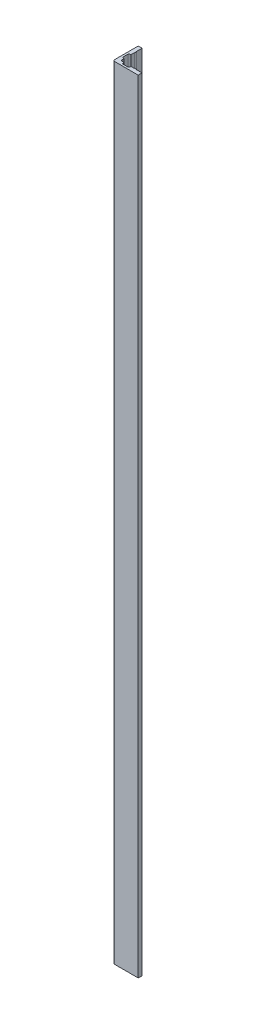
ISO-10303-21;
HEADER;
FILE_DESCRIPTION(('STEP AP214'),'2;1');
FILE_NAME('part.step','',(''),(''),'','','');
FILE_SCHEMA(('AUTOMOTIVE_DESIGN { 1 0 10303 214 1 1 1 1 }'));
ENDSEC;
DATA;
#1=APPLICATION_CONTEXT('core data for automotive mechanical design processes');
#2=APPLICATION_PROTOCOL_DEFINITION('international standard','automotive_design',2000,#1);
#3=PRODUCT_CONTEXT('',#1,'mechanical');
#4=PRODUCT('Part','Part','',(#3));
#5=PRODUCT_RELATED_PRODUCT_CATEGORY('part','',(#4));
#6=PRODUCT_DEFINITION_FORMATION('','',#4);
#7=PRODUCT_DEFINITION_CONTEXT('part definition',#1,'design');
#8=PRODUCT_DEFINITION('design','',#6,#7);
#9=PRODUCT_DEFINITION_SHAPE('','',#8);
#10=(LENGTH_UNIT() NAMED_UNIT(*) SI_UNIT(.MILLI.,.METRE.));
#11=(NAMED_UNIT(*) PLANE_ANGLE_UNIT() SI_UNIT($,.RADIAN.));
#12=(NAMED_UNIT(*) SI_UNIT($,.STERADIAN.) SOLID_ANGLE_UNIT());
#13=UNCERTAINTY_MEASURE_WITH_UNIT(LENGTH_MEASURE(1.E-05),#10,'distance_accuracy_value','');
#14=(GEOMETRIC_REPRESENTATION_CONTEXT(3) GLOBAL_UNCERTAINTY_ASSIGNED_CONTEXT((#13)) GLOBAL_UNIT_ASSIGNED_CONTEXT((#10,
#11,#12)) REPRESENTATION_CONTEXT('',''));
#15=CARTESIAN_POINT('',(0.,0.,0.));
#16=DIRECTION('',(0.,0.,1.));
#17=DIRECTION('',(1.,0.,0.));
#18=AXIS2_PLACEMENT_3D('',#15,#16,#17);
#19=CARTESIAN_POINT('',(0.,1828.8,-50.));
#20=DIRECTION('',(-1.,0.,0.));
#21=DIRECTION('',(0.,0.,1.));
#22=AXIS2_PLACEMENT_3D('',#19,#20,#21);
#23=PLANE('',#22);
#24=DIRECTION('',(0.,0.,-1.));
#25=VECTOR('',#24,1.);
#26=CARTESIAN_POINT('',(0.,1828.8,-50.));
#27=LINE('',#26,#25);
#28=CARTESIAN_POINT('',(0.,1828.8,-3.66));
#29=VERTEX_POINT('',#28);
#30=CARTESIAN_POINT('',(0.,1828.8,-8.));
#31=VERTEX_POINT('',#30);
#32=EDGE_CURVE('E388',#29,#31,#27,.T.);
#33=ORIENTED_EDGE('',*,*,#32,.F.);
#34=DIRECTION('',(0.,-1.,0.));
#35=VECTOR('',#34,1.);
#36=CARTESIAN_POINT('',(0.,0.,-3.66));
#37=LINE('',#36,#35);
#38=CARTESIAN_POINT('',(0.,0.,-3.66));
#39=VERTEX_POINT('',#38);
#40=EDGE_CURVE('E350',#29,#39,#37,.T.);
#41=ORIENTED_EDGE('',*,*,#40,.T.);
#42=DIRECTION('',(0.,0.,-1.));
#43=VECTOR('',#42,1.);
#44=CARTESIAN_POINT('',(0.,0.,-50.));
#45=LINE('',#44,#43);
#46=CARTESIAN_POINT('',(0.,0.,-8.));
#47=VERTEX_POINT('',#46);
#48=EDGE_CURVE('E255',#39,#47,#45,.T.);
#49=ORIENTED_EDGE('',*,*,#48,.T.);
#50=DIRECTION('',(0.,1.,0.));
#51=VECTOR('',#50,1.);
#52=CARTESIAN_POINT('',(0.,0.,-8.));
#53=LINE('',#52,#51);
#54=EDGE_CURVE('E246',#47,#31,#53,.T.);
#55=ORIENTED_EDGE('',*,*,#54,.T.);
#56=EDGE_LOOP('',(#33,#41,#49,#55));
#57=FACE_BOUND('',#56,.T.);
#58=ADVANCED_FACE('F39',(#57),#23,.F.);
#59=CARTESIAN_POINT('',(0.,1828.8,0.));
#60=DIRECTION('',(0.,0.,1.));
#61=DIRECTION('',(1.,0.,0.));
#62=AXIS2_PLACEMENT_3D('',#59,#60,#61);
#63=PLANE('',#62);
#64=DIRECTION('',(-1.,0.,0.));
#65=VECTOR('',#64,1.);
#66=CARTESIAN_POINT('',(0.,0.,0.));
#67=LINE('',#66,#65);
#68=CARTESIAN_POINT('',(8.,0.,0.));
#69=VERTEX_POINT('',#68);
#70=CARTESIAN_POINT('',(3.66,0.,0.));
#71=VERTEX_POINT('',#70);
#72=EDGE_CURVE('E277',#69,#71,#67,.T.);
#73=ORIENTED_EDGE('',*,*,#72,.T.);
#74=DIRECTION('',(0.,-1.,0.));
#75=VECTOR('',#74,1.);
#76=CARTESIAN_POINT('',(3.66,1828.8,0.));
#77=LINE('',#76,#75);
#78=CARTESIAN_POINT('',(3.66,1828.8,0.));
#79=VERTEX_POINT('',#78);
#80=EDGE_CURVE('E354',#71,#79,#77,.F.);
#81=ORIENTED_EDGE('',*,*,#80,.T.);
#82=DIRECTION('',(-1.,0.,0.));
#83=VECTOR('',#82,1.);
#84=CARTESIAN_POINT('',(0.,1828.8,0.));
#85=LINE('',#84,#83);
#86=CARTESIAN_POINT('',(8.,1828.8,0.));
#87=VERTEX_POINT('',#86);
#88=EDGE_CURVE('E373',#87,#79,#85,.T.);
#89=ORIENTED_EDGE('',*,*,#88,.F.);
#90=DIRECTION('',(0.,1.,0.));
#91=VECTOR('',#90,1.);
#92=CARTESIAN_POINT('',(8.,0.,0.));
#93=LINE('',#92,#91);
#94=EDGE_CURVE('E403',#69,#87,#93,.T.);
#95=ORIENTED_EDGE('',*,*,#94,.F.);
#96=EDGE_LOOP('',(#73,#81,#89,#95));
#97=FACE_BOUND('',#96,.T.);
#98=ADVANCED_FACE('F401',(#97),#63,.F.);
#99=CARTESIAN_POINT('',(31.75,0.,0.));
#100=VERTEX_POINT('',#99);
#101=CARTESIAN_POINT('',(23.75,0.,0.));
#102=VERTEX_POINT('',#101);
#103=EDGE_CURVE('E282',#100,#102,#67,.T.);
#104=ORIENTED_EDGE('',*,*,#103,.T.);
#105=DIRECTION('',(0.,1.,0.));
#106=VECTOR('',#105,1.);
#107=CARTESIAN_POINT('',(23.75,0.,0.));
#108=LINE('',#107,#106);
#109=CARTESIAN_POINT('',(23.75,1828.8,0.));
#110=VERTEX_POINT('',#109);
#111=EDGE_CURVE('E442',#102,#110,#108,.T.);
#112=ORIENTED_EDGE('',*,*,#111,.T.);
#113=CARTESIAN_POINT('',(31.75,1828.8,0.));
#114=VERTEX_POINT('',#113);
#115=EDGE_CURVE('E372',#114,#110,#85,.T.);
#116=ORIENTED_EDGE('',*,*,#115,.F.);
#117=DIRECTION('',(0.,1.,0.));
#118=VECTOR('',#117,1.);
#119=CARTESIAN_POINT('',(31.75,0.,0.));
#120=LINE('',#119,#118);
#121=EDGE_CURVE('E468',#100,#114,#120,.T.);
#122=ORIENTED_EDGE('',*,*,#121,.F.);
#123=EDGE_LOOP('',(#104,#112,#116,#122));
#124=FACE_BOUND('',#123,.T.);
#125=ADVANCED_FACE('F568',(#124),#63,.F.);
#126=CARTESIAN_POINT('',(0.,1828.8,-35.75));
#127=VERTEX_POINT('',#126);
#128=CARTESIAN_POINT('',(0.,1828.8,-50.));
#129=VERTEX_POINT('',#128);
#130=EDGE_CURVE('E281',#127,#129,#27,.T.);
#131=ORIENTED_EDGE('',*,*,#130,.F.);
#132=DIRECTION('',(0.,1.,0.));
#133=VECTOR('',#132,1.);
#134=CARTESIAN_POINT('',(0.,0.,-35.75));
#135=LINE('',#134,#133);
#136=CARTESIAN_POINT('',(0.,0.,-35.75));
#137=VERTEX_POINT('',#136);
#138=EDGE_CURVE('E261',#137,#127,#135,.T.);
#139=ORIENTED_EDGE('',*,*,#138,.F.);
#140=CARTESIAN_POINT('',(0.,0.,-50.));
#141=VERTEX_POINT('',#140);
#142=EDGE_CURVE('E256',#137,#141,#45,.T.);
#143=ORIENTED_EDGE('',*,*,#142,.T.);
#144=DIRECTION('',(0.,-1.,0.));
#145=VECTOR('',#144,1.);
#146=CARTESIAN_POINT('',(0.,1828.8,-50.));
#147=LINE('',#146,#145);
#148=EDGE_CURVE('E295',#129,#141,#147,.T.);
#149=ORIENTED_EDGE('',*,*,#148,.F.);
#150=EDGE_LOOP('',(#131,#139,#143,#149));
#151=FACE_BOUND('',#150,.T.);
#152=ADVANCED_FACE('F564',(#151),#23,.F.);
#153=CARTESIAN_POINT('',(0.,1828.8,-23.75));
#154=VERTEX_POINT('',#153);
#155=CARTESIAN_POINT('',(0.,1828.8,-31.75));
#156=VERTEX_POINT('',#155);
#157=EDGE_CURVE('E244',#154,#156,#27,.T.);
#158=ORIENTED_EDGE('',*,*,#157,.F.);
#159=DIRECTION('',(0.,1.,0.));
#160=VECTOR('',#159,1.);
#161=CARTESIAN_POINT('',(0.,0.,-23.75));
#162=LINE('',#161,#160);
#163=CARTESIAN_POINT('',(0.,0.,-23.75));
#164=VERTEX_POINT('',#163);
#165=EDGE_CURVE('E228',#164,#154,#162,.T.);
#166=ORIENTED_EDGE('',*,*,#165,.F.);
#167=CARTESIAN_POINT('',(0.,0.,-31.75));
#168=VERTEX_POINT('',#167);
#169=EDGE_CURVE('E242',#164,#168,#45,.T.);
#170=ORIENTED_EDGE('',*,*,#169,.T.);
#171=DIRECTION('',(0.,1.,0.));
#172=VECTOR('',#171,1.);
#173=CARTESIAN_POINT('',(0.,0.,-31.75));
#174=LINE('',#173,#172);
#175=EDGE_CURVE('E503',#168,#156,#174,.T.);
#176=ORIENTED_EDGE('',*,*,#175,.T.);
#177=EDGE_LOOP('',(#158,#166,#170,#176));
#178=FACE_BOUND('',#177,.T.);
#179=ADVANCED_FACE('F240',(#178),#23,.F.);
#180=CARTESIAN_POINT('',(-9.,1828.8,-50.));
#181=DIRECTION('',(0.,0.,1.));
#182=DIRECTION('',(1.,0.,0.));
#183=AXIS2_PLACEMENT_3D('',#180,#181,#182);
#184=PLANE('',#183);
#185=DIRECTION('',(-1.,0.,0.));
#186=VECTOR('',#185,1.);
#187=CARTESIAN_POINT('',(-9.,0.,-50.));
#188=LINE('',#187,#186);
#189=CARTESIAN_POINT('',(-9.,0.,-50.));
#190=VERTEX_POINT('',#189);
#191=EDGE_CURVE('E260',#141,#190,#188,.T.);
#192=ORIENTED_EDGE('',*,*,#191,.T.);
#193=DIRECTION('',(0.,-1.,0.));
#194=VECTOR('',#193,1.);
#195=CARTESIAN_POINT('',(-9.,1828.8,-50.));
#196=LINE('',#195,#194);
#197=CARTESIAN_POINT('',(-9.,1828.8,-50.));
#198=VERTEX_POINT('',#197);
#199=EDGE_CURVE('E291',#198,#190,#196,.T.);
#200=ORIENTED_EDGE('',*,*,#199,.F.);
#201=DIRECTION('',(-1.,0.,0.));
#202=VECTOR('',#201,1.);
#203=CARTESIAN_POINT('',(-9.,1828.8,-50.));
#204=LINE('',#203,#202);
#205=EDGE_CURVE('E385',#129,#198,#204,.T.);
#206=ORIENTED_EDGE('',*,*,#205,.F.);
#207=ORIENTED_EDGE('',*,*,#148,.T.);
#208=EDGE_LOOP('',(#192,#200,#206,#207));
#209=FACE_BOUND('',#208,.T.);
#210=ADVANCED_FACE('F576',(#209),#184,.F.);
#211=CARTESIAN_POINT('',(-9.,1828.8,9.00000000000001));
#212=DIRECTION('',(1.,0.,0.));
#213=DIRECTION('',(0.,0.,-1.));
#214=AXIS2_PLACEMENT_3D('',#211,#212,#213);
#215=PLANE('',#214);
#216=DIRECTION('',(0.,0.,1.));
#217=VECTOR('',#216,1.);
#218=CARTESIAN_POINT('',(-9.,0.,9.00000000000001));
#219=LINE('',#218,#217);
#220=CARTESIAN_POINT('',(-9.,0.,5.34000000000001));
#221=VERTEX_POINT('',#220);
#222=EDGE_CURVE('E268',#190,#221,#219,.T.);
#223=ORIENTED_EDGE('',*,*,#222,.T.);
#224=DIRECTION('',(0.,-1.,0.));
#225=VECTOR('',#224,1.);
#226=CARTESIAN_POINT('',(-9.,1828.8,5.34000000000001));
#227=LINE('',#226,#225);
#228=CARTESIAN_POINT('',(-9.,1828.8,5.34000000000001));
#229=VERTEX_POINT('',#228);
#230=EDGE_CURVE('E48',#221,#229,#227,.F.);
#231=ORIENTED_EDGE('',*,*,#230,.T.);
#232=DIRECTION('',(0.,0.,1.));
#233=VECTOR('',#232,1.);
#234=CARTESIAN_POINT('',(-9.,1828.8,9.00000000000001));
#235=LINE('',#234,#233);
#236=EDGE_CURVE('E382',#198,#229,#235,.T.);
#237=ORIENTED_EDGE('',*,*,#236,.F.);
#238=ORIENTED_EDGE('',*,*,#199,.T.);
#239=EDGE_LOOP('',(#223,#231,#237,#238));
#240=FACE_BOUND('',#239,.T.);
#241=ADVANCED_FACE('F580',(#240),#215,.F.);
#242=CARTESIAN_POINT('',(50.,1828.8,9.));
#243=DIRECTION('',(0.,0.,-1.));
#244=DIRECTION('',(-1.,0.,0.));
#245=AXIS2_PLACEMENT_3D('',#242,#243,#244);
#246=PLANE('',#245);
#247=DIRECTION('',(1.,0.,0.));
#248=VECTOR('',#247,1.);
#249=CARTESIAN_POINT('',(50.,1828.8,9.));
#250=LINE('',#249,#248);
#251=CARTESIAN_POINT('',(-5.33999999999998,1828.8,9.00000000000001));
#252=VERTEX_POINT('',#251);
#253=CARTESIAN_POINT('',(50.,1828.8,9.));
#254=VERTEX_POINT('',#253);
#255=EDGE_CURVE('E380',#252,#254,#250,.T.);
#256=ORIENTED_EDGE('',*,*,#255,.F.);
#257=DIRECTION('',(0.,-1.,0.));
#258=VECTOR('',#257,1.);
#259=CARTESIAN_POINT('',(-5.34,1828.8,9.00000000000001));
#260=LINE('',#259,#258);
#261=CARTESIAN_POINT('',(-5.33999999999998,0.,9.00000000000001));
#262=VERTEX_POINT('',#261);
#263=EDGE_CURVE('E363',#252,#262,#260,.T.);
#264=ORIENTED_EDGE('',*,*,#263,.T.);
#265=DIRECTION('',(1.,0.,0.));
#266=VECTOR('',#265,1.);
#267=CARTESIAN_POINT('',(50.,0.,9.));
#268=LINE('',#267,#266);
#269=CARTESIAN_POINT('',(50.,0.,9.));
#270=VERTEX_POINT('',#269);
#271=EDGE_CURVE('E271',#262,#270,#268,.T.);
#272=ORIENTED_EDGE('',*,*,#271,.T.);
#273=DIRECTION('',(0.,-1.,0.));
#274=VECTOR('',#273,1.);
#275=CARTESIAN_POINT('',(50.,1828.8,9.));
#276=LINE('',#275,#274);
#277=EDGE_CURVE('E287',#254,#270,#276,.T.);
#278=ORIENTED_EDGE('',*,*,#277,.F.);
#279=EDGE_LOOP('',(#256,#264,#272,#278));
#280=FACE_BOUND('',#279,.T.);
#281=ADVANCED_FACE('F585',(#280),#246,.F.);
#282=CARTESIAN_POINT('',(50.,1828.8,0.));
#283=DIRECTION('',(-1.,0.,0.));
#284=DIRECTION('',(0.,0.,1.));
#285=AXIS2_PLACEMENT_3D('',#282,#283,#284);
#286=PLANE('',#285);
#287=DIRECTION('',(0.,0.,-1.));
#288=VECTOR('',#287,1.);
#289=CARTESIAN_POINT('',(50.,0.,0.));
#290=LINE('',#289,#288);
#291=CARTESIAN_POINT('',(50.,0.,0.));
#292=VERTEX_POINT('',#291);
#293=EDGE_CURVE('E274',#270,#292,#290,.T.);
#294=ORIENTED_EDGE('',*,*,#293,.T.);
#295=DIRECTION('',(0.,-1.,0.));
#296=VECTOR('',#295,1.);
#297=CARTESIAN_POINT('',(50.,1828.8,0.));
#298=LINE('',#297,#296);
#299=CARTESIAN_POINT('',(50.,1828.8,0.));
#300=VERTEX_POINT('',#299);
#301=EDGE_CURVE('E283',#300,#292,#298,.T.);
#302=ORIENTED_EDGE('',*,*,#301,.F.);
#303=DIRECTION('',(0.,0.,-1.));
#304=VECTOR('',#303,1.);
#305=CARTESIAN_POINT('',(50.,1828.8,0.));
#306=LINE('',#305,#304);
#307=EDGE_CURVE('E378',#254,#300,#306,.T.);
#308=ORIENTED_EDGE('',*,*,#307,.F.);
#309=ORIENTED_EDGE('',*,*,#277,.T.);
#310=EDGE_LOOP('',(#294,#302,#308,#309));
#311=FACE_BOUND('',#310,.T.);
#312=ADVANCED_FACE('F590',(#311),#286,.F.);
#313=CARTESIAN_POINT('',(35.75,0.,0.));
#314=VERTEX_POINT('',#313);
#315=EDGE_CURVE('E278',#292,#314,#67,.T.);
#316=ORIENTED_EDGE('',*,*,#315,.T.);
#317=DIRECTION('',(0.,1.,0.));
#318=VECTOR('',#317,1.);
#319=CARTESIAN_POINT('',(35.75,0.,0.));
#320=LINE('',#319,#318);
#321=CARTESIAN_POINT('',(35.75,1828.8,0.));
#322=VERTEX_POINT('',#321);
#323=EDGE_CURVE('E486',#314,#322,#320,.T.);
#324=ORIENTED_EDGE('',*,*,#323,.T.);
#325=EDGE_CURVE('E264',#300,#322,#85,.T.);
#326=ORIENTED_EDGE('',*,*,#325,.F.);
#327=ORIENTED_EDGE('',*,*,#301,.T.);
#328=EDGE_LOOP('',(#316,#324,#326,#327));
#329=FACE_BOUND('',#328,.T.);
#330=ADVANCED_FACE('F570',(#329),#63,.F.);
#331=CARTESIAN_POINT('',(0.,1828.8,0.));
#332=DIRECTION('',(0.,1.,0.));
#333=DIRECTION('',(0.,0.,1.));
#334=AXIS2_PLACEMENT_3D('',#331,#332,#333);
#335=PLANE('',#334);
#336=ORIENTED_EDGE('',*,*,#236,.T.);
#337=CARTESIAN_POINT('',(-5.34,1828.8,5.34000000000001));
#338=DIRECTION('',(0.,1.,0.));
#339=DIRECTION('',(0.,0.,1.));
#340=AXIS2_PLACEMENT_3D('',#337,#338,#339);
#341=CIRCLE('',#340,3.66);
#342=EDGE_CURVE('E11',#229,#252,#341,.T.);
#343=ORIENTED_EDGE('',*,*,#342,.T.);
#344=ORIENTED_EDGE('',*,*,#255,.T.);
#345=ORIENTED_EDGE('',*,*,#307,.T.);
#346=ORIENTED_EDGE('',*,*,#325,.T.);
#347=DIRECTION('',(0.,0.,-1.));
#348=VECTOR('',#347,1.);
#349=CARTESIAN_POINT('',(35.75,1828.8,0.));
#350=LINE('',#349,#348);
#351=CARTESIAN_POINT('',(35.75,1828.8,-1.));
#352=VERTEX_POINT('',#351);
#353=EDGE_CURVE('E472',#322,#352,#350,.T.);
#354=ORIENTED_EDGE('',*,*,#353,.T.);
#355=DIRECTION('',(-1.,0.,0.));
#356=VECTOR('',#355,1.);
#357=CARTESIAN_POINT('',(31.75,1828.8,-1.));
#358=LINE('',#357,#356);
#359=CARTESIAN_POINT('',(31.75,1828.8,-1.));
#360=VERTEX_POINT('',#359);
#361=EDGE_CURVE('E460',#352,#360,#358,.T.);
#362=ORIENTED_EDGE('',*,*,#361,.T.);
#363=DIRECTION('',(0.,0.,1.));
#364=VECTOR('',#363,1.);
#365=CARTESIAN_POINT('',(31.75,1828.8,0.));
#366=LINE('',#365,#364);
#367=EDGE_CURVE('E451',#360,#114,#366,.T.);
#368=ORIENTED_EDGE('',*,*,#367,.T.);
#369=ORIENTED_EDGE('',*,*,#115,.T.);
#370=DIRECTION('',(0.,0.,-1.));
#371=VECTOR('',#370,1.);
#372=CARTESIAN_POINT('',(23.75,1828.8,0.));
#373=LINE('',#372,#371);
#374=CARTESIAN_POINT('',(23.75,1828.8,2.5));
#375=VERTEX_POINT('',#374);
#376=EDGE_CURVE('E436',#375,#110,#373,.T.);
#377=ORIENTED_EDGE('',*,*,#376,.F.);
#378=CARTESIAN_POINT('',(21.75,1828.8,2.5));
#379=DIRECTION('',(0.,1.,0.));
#380=DIRECTION('',(0.,0.,1.));
#381=AXIS2_PLACEMENT_3D('',#378,#379,#380);
#382=CIRCLE('',#381,2.);
#383=CARTESIAN_POINT('',(21.75,1828.8,4.5));
#384=VERTEX_POINT('',#383);
#385=EDGE_CURVE('E326',#375,#384,#382,.F.);
#386=ORIENTED_EDGE('',*,*,#385,.T.);
#387=DIRECTION('',(1.,0.,0.));
#388=VECTOR('',#387,1.);
#389=CARTESIAN_POINT('',(8.,1828.8,4.5));
#390=LINE('',#389,#388);
#391=CARTESIAN_POINT('',(10.,1828.8,4.5));
#392=VERTEX_POINT('',#391);
#393=EDGE_CURVE('E427',#392,#384,#390,.T.);
#394=ORIENTED_EDGE('',*,*,#393,.F.);
#395=CARTESIAN_POINT('',(10.,1828.8,2.5));
#396=DIRECTION('',(0.,1.,0.));
#397=DIRECTION('',(0.,0.,1.));
#398=AXIS2_PLACEMENT_3D('',#395,#396,#397);
#399=CIRCLE('',#398,2.);
#400=CARTESIAN_POINT('',(8.,1828.8,2.5));
#401=VERTEX_POINT('',#400);
#402=EDGE_CURVE('E332',#392,#401,#399,.F.);
#403=ORIENTED_EDGE('',*,*,#402,.T.);
#404=DIRECTION('',(0.,0.,1.));
#405=VECTOR('',#404,1.);
#406=CARTESIAN_POINT('',(8.,1828.8,0.));
#407=LINE('',#406,#405);
#408=EDGE_CURVE('E423',#87,#401,#407,.T.);
#409=ORIENTED_EDGE('',*,*,#408,.F.);
#410=ORIENTED_EDGE('',*,*,#88,.T.);
#411=CARTESIAN_POINT('',(3.66,1828.8,-3.66));
#412=DIRECTION('',(0.,1.,0.));
#413=DIRECTION('',(0.,0.,1.));
#414=AXIS2_PLACEMENT_3D('',#411,#412,#413);
#415=CIRCLE('',#414,3.66);
#416=EDGE_CURVE('E360',#79,#29,#415,.F.);
#417=ORIENTED_EDGE('',*,*,#416,.T.);
#418=ORIENTED_EDGE('',*,*,#32,.T.);
#419=DIRECTION('',(1.,0.,0.));
#420=VECTOR('',#419,1.);
#421=CARTESIAN_POINT('',(0.,1828.8,-8.));
#422=LINE('',#421,#420);
#423=CARTESIAN_POINT('',(-2.5,1828.8,-8.));
#424=VERTEX_POINT('',#423);
#425=EDGE_CURVE('E236',#424,#31,#422,.T.);
#426=ORIENTED_EDGE('',*,*,#425,.F.);
#427=CARTESIAN_POINT('',(-2.5,1828.8,-10.));
#428=DIRECTION('',(0.,1.,0.));
#429=DIRECTION('',(0.,0.,1.));
#430=AXIS2_PLACEMENT_3D('',#427,#428,#429);
#431=CIRCLE('',#430,2.);
#432=CARTESIAN_POINT('',(-4.5,1828.8,-10.));
#433=VERTEX_POINT('',#432);
#434=EDGE_CURVE('E338',#424,#433,#431,.F.);
#435=ORIENTED_EDGE('',*,*,#434,.T.);
#436=DIRECTION('',(0.,0.,1.));
#437=VECTOR('',#436,1.);
#438=CARTESIAN_POINT('',(-4.5,1828.8,-8.));
#439=LINE('',#438,#437);
#440=CARTESIAN_POINT('',(-4.5,1828.8,-21.75));
#441=VERTEX_POINT('',#440);
#442=EDGE_CURVE('E532',#441,#433,#439,.T.);
#443=ORIENTED_EDGE('',*,*,#442,.F.);
#444=CARTESIAN_POINT('',(-2.5,1828.8,-21.75));
#445=DIRECTION('',(0.,1.,0.));
#446=DIRECTION('',(0.,0.,1.));
#447=AXIS2_PLACEMENT_3D('',#444,#445,#446);
#448=CIRCLE('',#447,2.);
#449=CARTESIAN_POINT('',(-2.5,1828.8,-23.75));
#450=VERTEX_POINT('',#449);
#451=EDGE_CURVE('E344',#441,#450,#448,.F.);
#452=ORIENTED_EDGE('',*,*,#451,.T.);
#453=DIRECTION('',(-1.,0.,0.));
#454=VECTOR('',#453,1.);
#455=CARTESIAN_POINT('',(0.,1828.8,-23.75));
#456=LINE('',#455,#454);
#457=EDGE_CURVE('E529',#154,#450,#456,.T.);
#458=ORIENTED_EDGE('',*,*,#457,.F.);
#459=ORIENTED_EDGE('',*,*,#157,.T.);
#460=DIRECTION('',(1.,0.,0.));
#461=VECTOR('',#460,1.);
#462=CARTESIAN_POINT('',(0.,1828.8,-31.75));
#463=LINE('',#462,#461);
#464=CARTESIAN_POINT('',(1.,1828.8,-31.75));
#465=VERTEX_POINT('',#464);
#466=EDGE_CURVE('E482',#156,#465,#463,.T.);
#467=ORIENTED_EDGE('',*,*,#466,.T.);
#468=DIRECTION('',(0.,0.,-1.));
#469=VECTOR('',#468,1.);
#470=CARTESIAN_POINT('',(1.,1828.8,-31.75));
#471=LINE('',#470,#469);
#472=CARTESIAN_POINT('',(1.,1828.8,-35.75));
#473=VERTEX_POINT('',#472);
#474=EDGE_CURVE('E507',#465,#473,#471,.T.);
#475=ORIENTED_EDGE('',*,*,#474,.T.);
#476=DIRECTION('',(-1.,0.,0.));
#477=VECTOR('',#476,1.);
#478=CARTESIAN_POINT('',(0.,1828.8,-35.75));
#479=LINE('',#478,#477);
#480=EDGE_CURVE('E495',#473,#127,#479,.T.);
#481=ORIENTED_EDGE('',*,*,#480,.T.);
#482=ORIENTED_EDGE('',*,*,#130,.T.);
#483=ORIENTED_EDGE('',*,*,#205,.T.);
#484=EDGE_LOOP('',(#336,#343,#344,#345,#346,#354,#362,#368,#369,#377,#386,#394,#403,#409,#410,
#417,#418,#426,#435,#443,#452,#458,#459,#467,#475,#481,#482,#483));
#485=FACE_BOUND('',#484,.T.);
#486=ADVANCED_FACE('F411',(#485),#335,.T.);
#487=CARTESIAN_POINT('',(0.,0.,0.));
#488=DIRECTION('',(0.,1.,0.));
#489=DIRECTION('',(0.,0.,1.));
#490=AXIS2_PLACEMENT_3D('',#487,#488,#489);
#491=PLANE('',#490);
#492=ORIENTED_EDGE('',*,*,#271,.F.);
#493=CARTESIAN_POINT('',(-5.34,0.,5.34000000000001));
#494=DIRECTION('',(0.,1.,0.));
#495=DIRECTION('',(0.,0.,1.));
#496=AXIS2_PLACEMENT_3D('',#493,#494,#495);
#497=CIRCLE('',#496,3.66);
#498=EDGE_CURVE('E62',#262,#221,#497,.F.);
#499=ORIENTED_EDGE('',*,*,#498,.T.);
#500=ORIENTED_EDGE('',*,*,#222,.F.);
#501=ORIENTED_EDGE('',*,*,#191,.F.);
#502=ORIENTED_EDGE('',*,*,#142,.F.);
#503=DIRECTION('',(-1.,0.,0.));
#504=VECTOR('',#503,1.);
#505=CARTESIAN_POINT('',(0.,0.,-35.75));
#506=LINE('',#505,#504);
#507=CARTESIAN_POINT('',(1.,0.,-35.75));
#508=VERTEX_POINT('',#507);
#509=EDGE_CURVE('E499',#508,#137,#506,.T.);
#510=ORIENTED_EDGE('',*,*,#509,.F.);
#511=DIRECTION('',(0.,0.,-1.));
#512=VECTOR('',#511,1.);
#513=CARTESIAN_POINT('',(1.,0.,-31.75));
#514=LINE('',#513,#512);
#515=CARTESIAN_POINT('',(1.,0.,-31.75));
#516=VERTEX_POINT('',#515);
#517=EDGE_CURVE('E494',#516,#508,#514,.T.);
#518=ORIENTED_EDGE('',*,*,#517,.F.);
#519=DIRECTION('',(1.,0.,0.));
#520=VECTOR('',#519,1.);
#521=CARTESIAN_POINT('',(0.,0.,-31.75));
#522=LINE('',#521,#520);
#523=EDGE_CURVE('E253',#168,#516,#522,.T.);
#524=ORIENTED_EDGE('',*,*,#523,.F.);
#525=ORIENTED_EDGE('',*,*,#169,.F.);
#526=DIRECTION('',(-1.,0.,0.));
#527=VECTOR('',#526,1.);
#528=CARTESIAN_POINT('',(0.,0.,-23.75));
#529=LINE('',#528,#527);
#530=CARTESIAN_POINT('',(-2.5,0.,-23.75));
#531=VERTEX_POINT('',#530);
#532=EDGE_CURVE('E224',#164,#531,#529,.T.);
#533=ORIENTED_EDGE('',*,*,#532,.T.);
#534=CARTESIAN_POINT('',(-2.5,0.,-21.75));
#535=DIRECTION('',(0.,1.,0.));
#536=DIRECTION('',(0.,0.,1.));
#537=AXIS2_PLACEMENT_3D('',#534,#535,#536);
#538=CIRCLE('',#537,2.);
#539=CARTESIAN_POINT('',(-4.5,0.,-21.75));
#540=VERTEX_POINT('',#539);
#541=EDGE_CURVE('E347',#531,#540,#538,.T.);
#542=ORIENTED_EDGE('',*,*,#541,.T.);
#543=DIRECTION('',(0.,0.,1.));
#544=VECTOR('',#543,1.);
#545=CARTESIAN_POINT('',(-4.5,0.,-8.));
#546=LINE('',#545,#544);
#547=CARTESIAN_POINT('',(-4.5,0.,-10.));
#548=VERTEX_POINT('',#547);
#549=EDGE_CURVE('E235',#540,#548,#546,.T.);
#550=ORIENTED_EDGE('',*,*,#549,.T.);
#551=CARTESIAN_POINT('',(-2.5,0.,-10.));
#552=DIRECTION('',(0.,1.,0.));
#553=DIRECTION('',(0.,0.,1.));
#554=AXIS2_PLACEMENT_3D('',#551,#552,#553);
#555=CIRCLE('',#554,2.);
#556=CARTESIAN_POINT('',(-2.5,0.,-8.));
#557=VERTEX_POINT('',#556);
#558=EDGE_CURVE('E341',#548,#557,#555,.T.);
#559=ORIENTED_EDGE('',*,*,#558,.T.);
#560=DIRECTION('',(1.,0.,0.));
#561=VECTOR('',#560,1.);
#562=CARTESIAN_POINT('',(0.,0.,-8.));
#563=LINE('',#562,#561);
#564=EDGE_CURVE('E247',#557,#47,#563,.T.);
#565=ORIENTED_EDGE('',*,*,#564,.T.);
#566=ORIENTED_EDGE('',*,*,#48,.F.);
#567=CARTESIAN_POINT('',(3.66,0.,-3.66));
#568=DIRECTION('',(0.,1.,0.));
#569=DIRECTION('',(0.,0.,1.));
#570=AXIS2_PLACEMENT_3D('',#567,#568,#569);
#571=CIRCLE('',#570,3.66);
#572=EDGE_CURVE('E357',#39,#71,#571,.T.);
#573=ORIENTED_EDGE('',*,*,#572,.T.);
#574=ORIENTED_EDGE('',*,*,#72,.F.);
#575=DIRECTION('',(0.,0.,1.));
#576=VECTOR('',#575,1.);
#577=CARTESIAN_POINT('',(8.,0.,0.));
#578=LINE('',#577,#576);
#579=CARTESIAN_POINT('',(8.,0.,2.5));
#580=VERTEX_POINT('',#579);
#581=EDGE_CURVE('E432',#69,#580,#578,.T.);
#582=ORIENTED_EDGE('',*,*,#581,.T.);
#583=CARTESIAN_POINT('',(10.,0.,2.5));
#584=DIRECTION('',(0.,1.,0.));
#585=DIRECTION('',(0.,0.,1.));
#586=AXIS2_PLACEMENT_3D('',#583,#584,#585);
#587=CIRCLE('',#586,2.);
#588=CARTESIAN_POINT('',(10.,0.,4.5));
#589=VERTEX_POINT('',#588);
#590=EDGE_CURVE('E335',#580,#589,#587,.T.);
#591=ORIENTED_EDGE('',*,*,#590,.T.);
#592=DIRECTION('',(1.,0.,0.));
#593=VECTOR('',#592,1.);
#594=CARTESIAN_POINT('',(8.,0.,4.5));
#595=LINE('',#594,#593);
#596=CARTESIAN_POINT('',(21.75,0.,4.5));
#597=VERTEX_POINT('',#596);
#598=EDGE_CURVE('E435',#589,#597,#595,.T.);
#599=ORIENTED_EDGE('',*,*,#598,.T.);
#600=CARTESIAN_POINT('',(21.75,0.,2.5));
#601=DIRECTION('',(0.,1.,0.));
#602=DIRECTION('',(0.,0.,1.));
#603=AXIS2_PLACEMENT_3D('',#600,#601,#602);
#604=CIRCLE('',#603,2.);
#605=CARTESIAN_POINT('',(23.75,0.,2.5));
#606=VERTEX_POINT('',#605);
#607=EDGE_CURVE('E329',#597,#606,#604,.T.);
#608=ORIENTED_EDGE('',*,*,#607,.T.);
#609=DIRECTION('',(0.,0.,-1.));
#610=VECTOR('',#609,1.);
#611=CARTESIAN_POINT('',(23.75,0.,0.));
#612=LINE('',#611,#610);
#613=EDGE_CURVE('E440',#606,#102,#612,.T.);
#614=ORIENTED_EDGE('',*,*,#613,.T.);
#615=ORIENTED_EDGE('',*,*,#103,.F.);
#616=DIRECTION('',(0.,0.,1.));
#617=VECTOR('',#616,1.);
#618=CARTESIAN_POINT('',(31.75,0.,0.));
#619=LINE('',#618,#617);
#620=CARTESIAN_POINT('',(31.75,0.,-1.));
#621=VERTEX_POINT('',#620);
#622=EDGE_CURVE('E455',#621,#100,#619,.T.);
#623=ORIENTED_EDGE('',*,*,#622,.F.);
#624=DIRECTION('',(-1.,0.,0.));
#625=VECTOR('',#624,1.);
#626=CARTESIAN_POINT('',(31.75,0.,-1.));
#627=LINE('',#626,#625);
#628=CARTESIAN_POINT('',(35.75,0.,-1.));
#629=VERTEX_POINT('',#628);
#630=EDGE_CURVE('E464',#629,#621,#627,.T.);
#631=ORIENTED_EDGE('',*,*,#630,.F.);
#632=DIRECTION('',(0.,0.,-1.));
#633=VECTOR('',#632,1.);
#634=CARTESIAN_POINT('',(35.75,0.,0.));
#635=LINE('',#634,#633);
#636=EDGE_CURVE('E459',#314,#629,#635,.T.);
#637=ORIENTED_EDGE('',*,*,#636,.F.);
#638=ORIENTED_EDGE('',*,*,#315,.F.);
#639=ORIENTED_EDGE('',*,*,#293,.F.);
#640=EDGE_LOOP('',(#492,#499,#500,#501,#502,#510,#518,#524,#525,#533,#542,#550,#559,#565,#566,
#573,#574,#582,#591,#599,#608,#614,#615,#623,#631,#637,#638,#639));
#641=FACE_BOUND('',#640,.T.);
#642=ADVANCED_FACE('F250',(#641),#491,.F.);
#643=CARTESIAN_POINT('',(0.,0.,-35.75));
#644=DIRECTION('',(0.,0.,-1.));
#645=DIRECTION('',(-1.,0.,0.));
#646=AXIS2_PLACEMENT_3D('',#643,#644,#645);
#647=PLANE('',#646);
#648=ORIENTED_EDGE('',*,*,#480,.F.);
#649=DIRECTION('',(0.,1.,0.));
#650=VECTOR('',#649,1.);
#651=CARTESIAN_POINT('',(1.,0.,-35.75));
#652=LINE('',#651,#650);
#653=EDGE_CURVE('E517',#508,#473,#652,.T.);
#654=ORIENTED_EDGE('',*,*,#653,.F.);
#655=ORIENTED_EDGE('',*,*,#509,.T.);
#656=ORIENTED_EDGE('',*,*,#138,.T.);
#657=EDGE_LOOP('',(#648,#654,#655,#656));
#658=FACE_BOUND('',#657,.T.);
#659=ADVANCED_FACE('F599',(#658),#647,.T.);
#660=CARTESIAN_POINT('',(1.,0.,-31.75));
#661=DIRECTION('',(1.,0.,0.));
#662=DIRECTION('',(0.,0.,-1.));
#663=AXIS2_PLACEMENT_3D('',#660,#661,#662);
#664=PLANE('',#663);
#665=ORIENTED_EDGE('',*,*,#474,.F.);
#666=DIRECTION('',(0.,1.,0.));
#667=VECTOR('',#666,1.);
#668=CARTESIAN_POINT('',(1.,0.,-31.75));
#669=LINE('',#668,#667);
#670=EDGE_CURVE('E520',#516,#465,#669,.T.);
#671=ORIENTED_EDGE('',*,*,#670,.F.);
#672=ORIENTED_EDGE('',*,*,#517,.T.);
#673=ORIENTED_EDGE('',*,*,#653,.T.);
#674=EDGE_LOOP('',(#665,#671,#672,#673));
#675=FACE_BOUND('',#674,.T.);
#676=ADVANCED_FACE('F605',(#675),#664,.T.);
#677=CARTESIAN_POINT('',(0.,0.,-31.75));
#678=DIRECTION('',(0.,0.,1.));
#679=DIRECTION('',(1.,0.,0.));
#680=AXIS2_PLACEMENT_3D('',#677,#678,#679);
#681=PLANE('',#680);
#682=ORIENTED_EDGE('',*,*,#466,.F.);
#683=ORIENTED_EDGE('',*,*,#175,.F.);
#684=ORIENTED_EDGE('',*,*,#523,.T.);
#685=ORIENTED_EDGE('',*,*,#670,.T.);
#686=EDGE_LOOP('',(#682,#683,#684,#685));
#687=FACE_BOUND('',#686,.T.);
#688=ADVANCED_FACE('F526',(#687),#681,.T.);
#689=CARTESIAN_POINT('',(31.75,0.,0.));
#690=DIRECTION('',(-1.,0.,0.));
#691=DIRECTION('',(0.,0.,1.));
#692=AXIS2_PLACEMENT_3D('',#689,#690,#691);
#693=PLANE('',#692);
#694=ORIENTED_EDGE('',*,*,#367,.F.);
#695=DIRECTION('',(0.,1.,0.));
#696=VECTOR('',#695,1.);
#697=CARTESIAN_POINT('',(31.75,0.,-1.));
#698=LINE('',#697,#696);
#699=EDGE_CURVE('E479',#621,#360,#698,.T.);
#700=ORIENTED_EDGE('',*,*,#699,.F.);
#701=ORIENTED_EDGE('',*,*,#622,.T.);
#702=ORIENTED_EDGE('',*,*,#121,.T.);
#703=EDGE_LOOP('',(#694,#700,#701,#702));
#704=FACE_BOUND('',#703,.T.);
#705=ADVANCED_FACE('F604',(#704),#693,.T.);
#706=CARTESIAN_POINT('',(31.75,0.,-1.));
#707=DIRECTION('',(0.,0.,-1.));
#708=DIRECTION('',(-1.,0.,0.));
#709=AXIS2_PLACEMENT_3D('',#706,#707,#708);
#710=PLANE('',#709);
#711=ORIENTED_EDGE('',*,*,#361,.F.);
#712=DIRECTION('',(0.,1.,0.));
#713=VECTOR('',#712,1.);
#714=CARTESIAN_POINT('',(35.75,0.,-1.));
#715=LINE('',#714,#713);
#716=EDGE_CURVE('E483',#629,#352,#715,.T.);
#717=ORIENTED_EDGE('',*,*,#716,.F.);
#718=ORIENTED_EDGE('',*,*,#630,.T.);
#719=ORIENTED_EDGE('',*,*,#699,.T.);
#720=EDGE_LOOP('',(#711,#717,#718,#719));
#721=FACE_BOUND('',#720,.T.);
#722=ADVANCED_FACE('F614',(#721),#710,.T.);
#723=CARTESIAN_POINT('',(35.75,0.,0.));
#724=DIRECTION('',(1.,0.,0.));
#725=DIRECTION('',(0.,0.,-1.));
#726=AXIS2_PLACEMENT_3D('',#723,#724,#725);
#727=PLANE('',#726);
#728=ORIENTED_EDGE('',*,*,#353,.F.);
#729=ORIENTED_EDGE('',*,*,#323,.F.);
#730=ORIENTED_EDGE('',*,*,#636,.T.);
#731=ORIENTED_EDGE('',*,*,#716,.T.);
#732=EDGE_LOOP('',(#728,#729,#730,#731));
#733=FACE_BOUND('',#732,.T.);
#734=ADVANCED_FACE('F616',(#733),#727,.T.);
#735=CARTESIAN_POINT('',(8.,0.,0.));
#736=DIRECTION('',(-1.,0.,0.));
#737=DIRECTION('',(0.,0.,1.));
#738=AXIS2_PLACEMENT_3D('',#735,#736,#737);
#739=PLANE('',#738);
#740=ORIENTED_EDGE('',*,*,#408,.T.);
#741=DIRECTION('',(0.,1.,0.));
#742=VECTOR('',#741,1.);
#743=CARTESIAN_POINT('',(8.,0.,2.5));
#744=LINE('',#743,#742);
#745=EDGE_CURVE('E310',#401,#580,#744,.F.);
#746=ORIENTED_EDGE('',*,*,#745,.T.);
#747=ORIENTED_EDGE('',*,*,#581,.F.);
#748=ORIENTED_EDGE('',*,*,#94,.T.);
#749=EDGE_LOOP('',(#740,#746,#747,#748));
#750=FACE_BOUND('',#749,.T.);
#751=ADVANCED_FACE('F619',(#750),#739,.F.);
#752=CARTESIAN_POINT('',(23.75,0.,0.));
#753=DIRECTION('',(1.,0.,0.));
#754=DIRECTION('',(0.,0.,-1.));
#755=AXIS2_PLACEMENT_3D('',#752,#753,#754);
#756=PLANE('',#755);
#757=ORIENTED_EDGE('',*,*,#613,.F.);
#758=DIRECTION('',(0.,1.,0.));
#759=VECTOR('',#758,1.);
#760=CARTESIAN_POINT('',(23.75,1828.8,2.5));
#761=LINE('',#760,#759);
#762=EDGE_CURVE('E299',#606,#375,#761,.T.);
#763=ORIENTED_EDGE('',*,*,#762,.T.);
#764=ORIENTED_EDGE('',*,*,#376,.T.);
#765=ORIENTED_EDGE('',*,*,#111,.F.);
#766=EDGE_LOOP('',(#757,#763,#764,#765));
#767=FACE_BOUND('',#766,.T.);
#768=ADVANCED_FACE('F626',(#767),#756,.F.);
#769=CARTESIAN_POINT('',(8.,0.,4.5));
#770=DIRECTION('',(0.,0.,1.));
#771=DIRECTION('',(1.,0.,0.));
#772=AXIS2_PLACEMENT_3D('',#769,#770,#771);
#773=PLANE('',#772);
#774=ORIENTED_EDGE('',*,*,#393,.T.);
#775=DIRECTION('',(0.,1.,0.));
#776=VECTOR('',#775,1.);
#777=CARTESIAN_POINT('',(21.75,0.,4.5));
#778=LINE('',#777,#776);
#779=EDGE_CURVE('E307',#384,#597,#778,.F.);
#780=ORIENTED_EDGE('',*,*,#779,.T.);
#781=ORIENTED_EDGE('',*,*,#598,.F.);
#782=DIRECTION('',(0.,1.,0.));
#783=VECTOR('',#782,1.);
#784=CARTESIAN_POINT('',(10.,1828.8,4.5));
#785=LINE('',#784,#783);
#786=EDGE_CURVE('E303',#589,#392,#785,.T.);
#787=ORIENTED_EDGE('',*,*,#786,.T.);
#788=EDGE_LOOP('',(#774,#780,#781,#787));
#789=FACE_BOUND('',#788,.T.);
#790=ADVANCED_FACE('F628',(#789),#773,.F.);
#791=CARTESIAN_POINT('',(0.,0.,-8.));
#792=DIRECTION('',(0.,0.,1.));
#793=DIRECTION('',(1.,0.,0.));
#794=AXIS2_PLACEMENT_3D('',#791,#792,#793);
#795=PLANE('',#794);
#796=ORIENTED_EDGE('',*,*,#564,.F.);
#797=DIRECTION('',(0.,1.,0.));
#798=VECTOR('',#797,1.);
#799=CARTESIAN_POINT('',(-2.5,1828.8,-8.));
#800=LINE('',#799,#798);
#801=EDGE_CURVE('E313',#557,#424,#800,.T.);
#802=ORIENTED_EDGE('',*,*,#801,.T.);
#803=ORIENTED_EDGE('',*,*,#425,.T.);
#804=ORIENTED_EDGE('',*,*,#54,.F.);
#805=EDGE_LOOP('',(#796,#802,#803,#804));
#806=FACE_BOUND('',#805,.T.);
#807=ADVANCED_FACE('F549',(#806),#795,.F.);
#808=CARTESIAN_POINT('',(-4.5,0.,-8.));
#809=DIRECTION('',(-1.,0.,0.));
#810=DIRECTION('',(0.,0.,1.));
#811=AXIS2_PLACEMENT_3D('',#808,#809,#810);
#812=PLANE('',#811);
#813=ORIENTED_EDGE('',*,*,#442,.T.);
#814=DIRECTION('',(0.,1.,0.));
#815=VECTOR('',#814,1.);
#816=CARTESIAN_POINT('',(-4.5,0.,-10.));
#817=LINE('',#816,#815);
#818=EDGE_CURVE('E321',#433,#548,#817,.F.);
#819=ORIENTED_EDGE('',*,*,#818,.T.);
#820=ORIENTED_EDGE('',*,*,#549,.F.);
#821=DIRECTION('',(0.,1.,0.));
#822=VECTOR('',#821,1.);
#823=CARTESIAN_POINT('',(-4.5,1828.8,-21.75));
#824=LINE('',#823,#822);
#825=EDGE_CURVE('E317',#540,#441,#824,.T.);
#826=ORIENTED_EDGE('',*,*,#825,.T.);
#827=EDGE_LOOP('',(#813,#819,#820,#826));
#828=FACE_BOUND('',#827,.T.);
#829=ADVANCED_FACE('F551',(#828),#812,.F.);
#830=CARTESIAN_POINT('',(0.,0.,-23.75));
#831=DIRECTION('',(0.,0.,-1.));
#832=DIRECTION('',(-1.,0.,0.));
#833=AXIS2_PLACEMENT_3D('',#830,#831,#832);
#834=PLANE('',#833);
#835=ORIENTED_EDGE('',*,*,#457,.T.);
#836=DIRECTION('',(0.,1.,0.));
#837=VECTOR('',#836,1.);
#838=CARTESIAN_POINT('',(-2.5,0.,-23.75));
#839=LINE('',#838,#837);
#840=EDGE_CURVE('E231',#450,#531,#839,.F.);
#841=ORIENTED_EDGE('',*,*,#840,.T.);
#842=ORIENTED_EDGE('',*,*,#532,.F.);
#843=ORIENTED_EDGE('',*,*,#165,.T.);
#844=EDGE_LOOP('',(#835,#841,#842,#843));
#845=FACE_BOUND('',#844,.T.);
#846=ADVANCED_FACE('F227',(#845),#834,.F.);
#847=CARTESIAN_POINT('',(21.75,0.,2.5));
#848=DIRECTION('',(0.,-1.,0.));
#849=DIRECTION('',(0.,0.,-1.));
#850=AXIS2_PLACEMENT_3D('',#847,#848,#849);
#851=CYLINDRICAL_SURFACE('',#850,2.);
#852=ORIENTED_EDGE('',*,*,#607,.F.);
#853=ORIENTED_EDGE('',*,*,#779,.F.);
#854=ORIENTED_EDGE('',*,*,#385,.F.);
#855=ORIENTED_EDGE('',*,*,#762,.F.);
#856=EDGE_LOOP('',(#852,#853,#854,#855));
#857=FACE_BOUND('',#856,.T.);
#858=ADVANCED_FACE('F637',(#857),#851,.F.);
#859=CARTESIAN_POINT('',(10.,0.,2.5));
#860=DIRECTION('',(0.,-1.,0.));
#861=DIRECTION('',(0.,0.,-1.));
#862=AXIS2_PLACEMENT_3D('',#859,#860,#861);
#863=CYLINDRICAL_SURFACE('',#862,2.);
#864=ORIENTED_EDGE('',*,*,#590,.F.);
#865=ORIENTED_EDGE('',*,*,#745,.F.);
#866=ORIENTED_EDGE('',*,*,#402,.F.);
#867=ORIENTED_EDGE('',*,*,#786,.F.);
#868=EDGE_LOOP('',(#864,#865,#866,#867));
#869=FACE_BOUND('',#868,.T.);
#870=ADVANCED_FACE('F560',(#869),#863,.F.);
#871=CARTESIAN_POINT('',(-2.5,0.,-10.));
#872=DIRECTION('',(0.,-1.,0.));
#873=DIRECTION('',(0.,0.,-1.));
#874=AXIS2_PLACEMENT_3D('',#871,#872,#873);
#875=CYLINDRICAL_SURFACE('',#874,2.);
#876=ORIENTED_EDGE('',*,*,#558,.F.);
#877=ORIENTED_EDGE('',*,*,#818,.F.);
#878=ORIENTED_EDGE('',*,*,#434,.F.);
#879=ORIENTED_EDGE('',*,*,#801,.F.);
#880=EDGE_LOOP('',(#876,#877,#878,#879));
#881=FACE_BOUND('',#880,.T.);
#882=ADVANCED_FACE('F548',(#881),#875,.F.);
#883=CARTESIAN_POINT('',(-2.5,0.,-21.75));
#884=DIRECTION('',(0.,-1.,0.));
#885=DIRECTION('',(0.,0.,-1.));
#886=AXIS2_PLACEMENT_3D('',#883,#884,#885);
#887=CYLINDRICAL_SURFACE('',#886,2.);
#888=ORIENTED_EDGE('',*,*,#541,.F.);
#889=ORIENTED_EDGE('',*,*,#840,.F.);
#890=ORIENTED_EDGE('',*,*,#451,.F.);
#891=ORIENTED_EDGE('',*,*,#825,.F.);
#892=EDGE_LOOP('',(#888,#889,#890,#891));
#893=FACE_BOUND('',#892,.T.);
#894=ADVANCED_FACE('F553',(#893),#887,.F.);
#895=CARTESIAN_POINT('',(3.66,1828.8,-3.66));
#896=DIRECTION('',(0.,1.,0.));
#897=DIRECTION('',(0.,0.,1.));
#898=AXIS2_PLACEMENT_3D('',#895,#896,#897);
#899=CYLINDRICAL_SURFACE('',#898,3.66);
#900=ORIENTED_EDGE('',*,*,#416,.F.);
#901=ORIENTED_EDGE('',*,*,#80,.F.);
#902=ORIENTED_EDGE('',*,*,#572,.F.);
#903=ORIENTED_EDGE('',*,*,#40,.F.);
#904=EDGE_LOOP('',(#900,#901,#902,#903));
#905=FACE_BOUND('',#904,.T.);
#906=ADVANCED_FACE('F407',(#905),#899,.F.);
#907=CARTESIAN_POINT('',(-5.34,1828.8,5.34000000000001));
#908=DIRECTION('',(0.,-1.,0.));
#909=DIRECTION('',(0.,0.,-1.));
#910=AXIS2_PLACEMENT_3D('',#907,#908,#909);
#911=CYLINDRICAL_SURFACE('',#910,3.66);
#912=ORIENTED_EDGE('',*,*,#342,.F.);
#913=ORIENTED_EDGE('',*,*,#230,.F.);
#914=ORIENTED_EDGE('',*,*,#498,.F.);
#915=ORIENTED_EDGE('',*,*,#263,.F.);
#916=EDGE_LOOP('',(#912,#913,#914,#915));
#917=FACE_BOUND('',#916,.T.);
#918=ADVANCED_FACE('F41',(#917),#911,.T.);
#919=CLOSED_SHELL('',(#58,#98,#125,#152,#179,#210,#241,#281,#312,#330,#486,#642,#659,#676,#688,
#705,#722,#734,#751,#768,#790,#807,#829,#846,#858,#870,#882,#894,#906,#918));
#920=MANIFOLD_SOLID_BREP('B2',#919);
#921=ADVANCED_BREP_SHAPE_REPRESENTATION('',(#18,#920),#14);
#922=SHAPE_DEFINITION_REPRESENTATION(#9,#921);
ENDSEC;
END-ISO-10303-21;
